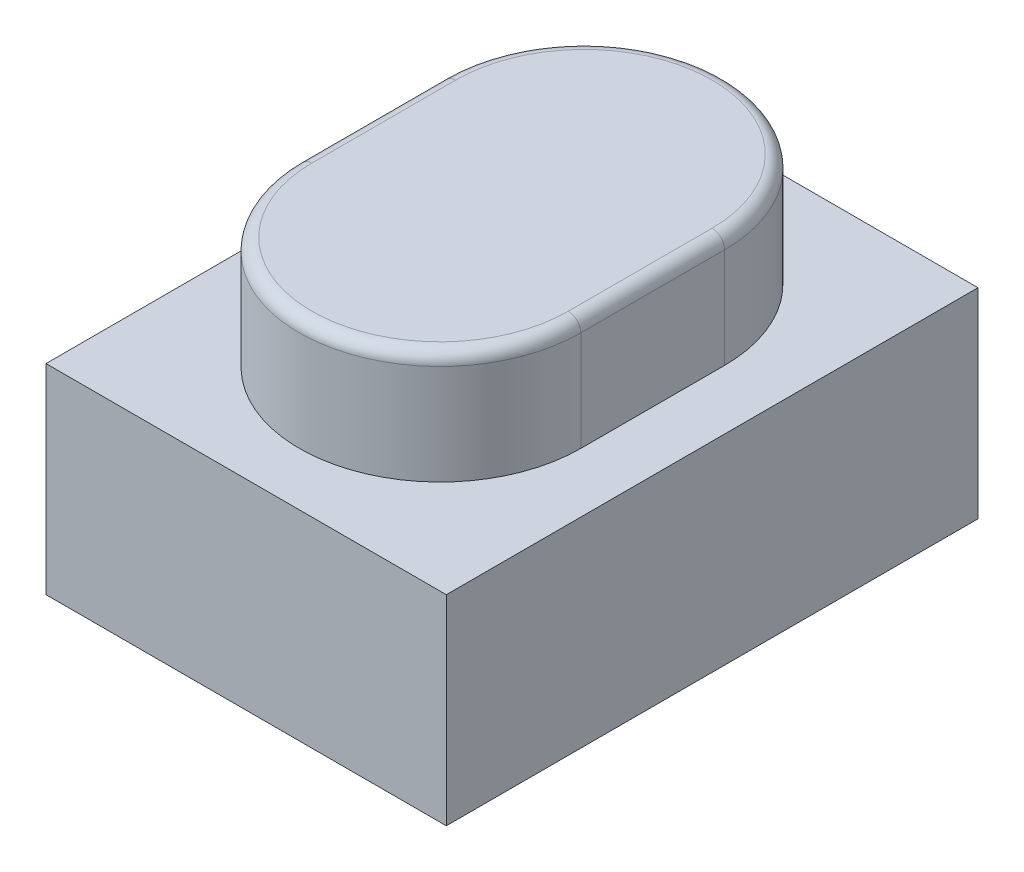
ISO-10303-21;
HEADER;
FILE_DESCRIPTION(('STEP AP214'),'2;1');
FILE_NAME('part.step','',(''),(''),'','','');
FILE_SCHEMA(('AUTOMOTIVE_DESIGN { 1 0 10303 214 1 1 1 1 }'));
ENDSEC;
DATA;
#1=APPLICATION_CONTEXT('core data for automotive mechanical design processes');
#2=APPLICATION_PROTOCOL_DEFINITION('international standard','automotive_design',2000,#1);
#3=PRODUCT_CONTEXT('',#1,'mechanical');
#4=PRODUCT('Part','Part','',(#3));
#5=PRODUCT_RELATED_PRODUCT_CATEGORY('part','',(#4));
#6=PRODUCT_DEFINITION_FORMATION('','',#4);
#7=PRODUCT_DEFINITION_CONTEXT('part definition',#1,'design');
#8=PRODUCT_DEFINITION('design','',#6,#7);
#9=PRODUCT_DEFINITION_SHAPE('','',#8);
#10=(LENGTH_UNIT() NAMED_UNIT(*) SI_UNIT(.MILLI.,.METRE.));
#11=(NAMED_UNIT(*) PLANE_ANGLE_UNIT() SI_UNIT($,.RADIAN.));
#12=(NAMED_UNIT(*) SI_UNIT($,.STERADIAN.) SOLID_ANGLE_UNIT());
#13=UNCERTAINTY_MEASURE_WITH_UNIT(LENGTH_MEASURE(1.E-05),#10,'distance_accuracy_value','');
#14=(GEOMETRIC_REPRESENTATION_CONTEXT(3) GLOBAL_UNCERTAINTY_ASSIGNED_CONTEXT((#13)) GLOBAL_UNIT_ASSIGNED_CONTEXT((#10,
#11,#12)) REPRESENTATION_CONTEXT('',''));
#15=CARTESIAN_POINT('',(0.,0.,0.));
#16=DIRECTION('',(0.,0.,1.));
#17=DIRECTION('',(1.,0.,0.));
#18=AXIS2_PLACEMENT_3D('',#15,#16,#17);
#19=CARTESIAN_POINT('',(1.6,1.6,-2.125));
#20=DIRECTION('',(-1.,0.,0.));
#21=DIRECTION('',(0.,0.,1.));
#22=AXIS2_PLACEMENT_3D('',#19,#20,#21);
#23=PLANE('',#22);
#24=DIRECTION('',(0.,0.,-1.));
#25=VECTOR('',#24,1.);
#26=CARTESIAN_POINT('',(1.6,0.,-2.125));
#27=LINE('',#26,#25);
#28=CARTESIAN_POINT('',(1.6,0.,2.125));
#29=VERTEX_POINT('',#28);
#30=CARTESIAN_POINT('',(1.6,0.,-2.125));
#31=VERTEX_POINT('',#30);
#32=EDGE_CURVE('E139',#29,#31,#27,.T.);
#33=ORIENTED_EDGE('',*,*,#32,.T.);
#34=DIRECTION('',(0.,-1.,0.));
#35=VECTOR('',#34,1.);
#36=CARTESIAN_POINT('',(1.6,1.6,-2.125));
#37=LINE('',#36,#35);
#38=CARTESIAN_POINT('',(1.6,1.6,-2.125));
#39=VERTEX_POINT('',#38);
#40=EDGE_CURVE('E166',#39,#31,#37,.T.);
#41=ORIENTED_EDGE('',*,*,#40,.F.);
#42=DIRECTION('',(0.,0.,-1.));
#43=VECTOR('',#42,1.);
#44=CARTESIAN_POINT('',(1.6,1.6,-2.125));
#45=LINE('',#44,#43);
#46=CARTESIAN_POINT('',(1.6,1.6,2.125));
#47=VERTEX_POINT('',#46);
#48=EDGE_CURVE('E140',#47,#39,#45,.T.);
#49=ORIENTED_EDGE('',*,*,#48,.F.);
#50=DIRECTION('',(0.,-1.,0.));
#51=VECTOR('',#50,1.);
#52=CARTESIAN_POINT('',(1.6,1.6,2.125));
#53=LINE('',#52,#51);
#54=EDGE_CURVE('E150',#47,#29,#53,.T.);
#55=ORIENTED_EDGE('',*,*,#54,.T.);
#56=EDGE_LOOP('',(#33,#41,#49,#55));
#57=FACE_BOUND('',#56,.T.);
#58=ADVANCED_FACE('F34',(#57),#23,.F.);
#59=CARTESIAN_POINT('',(-1.6,1.6,-2.125));
#60=DIRECTION('',(0.,0.,1.));
#61=DIRECTION('',(1.,0.,0.));
#62=AXIS2_PLACEMENT_3D('',#59,#60,#61);
#63=PLANE('',#62);
#64=DIRECTION('',(-1.,0.,0.));
#65=VECTOR('',#64,1.);
#66=CARTESIAN_POINT('',(-1.6,0.,-2.125));
#67=LINE('',#66,#65);
#68=CARTESIAN_POINT('',(-1.6,0.,-2.125));
#69=VERTEX_POINT('',#68);
#70=EDGE_CURVE('E153',#31,#69,#67,.T.);
#71=ORIENTED_EDGE('',*,*,#70,.T.);
#72=DIRECTION('',(0.,-1.,0.));
#73=VECTOR('',#72,1.);
#74=CARTESIAN_POINT('',(-1.6,1.6,-2.125));
#75=LINE('',#74,#73);
#76=CARTESIAN_POINT('',(-1.6,1.6,-2.125));
#77=VERTEX_POINT('',#76);
#78=EDGE_CURVE('E163',#77,#69,#75,.T.);
#79=ORIENTED_EDGE('',*,*,#78,.F.);
#80=DIRECTION('',(-1.,0.,0.));
#81=VECTOR('',#80,1.);
#82=CARTESIAN_POINT('',(-1.6,1.6,-2.125));
#83=LINE('',#82,#81);
#84=EDGE_CURVE('E143',#39,#77,#83,.T.);
#85=ORIENTED_EDGE('',*,*,#84,.F.);
#86=ORIENTED_EDGE('',*,*,#40,.T.);
#87=EDGE_LOOP('',(#71,#79,#85,#86));
#88=FACE_BOUND('',#87,.T.);
#89=ADVANCED_FACE('F221',(#88),#63,.F.);
#90=CARTESIAN_POINT('',(-1.6,1.6,-2.125));
#91=DIRECTION('',(1.,0.,0.));
#92=DIRECTION('',(0.,0.,-1.));
#93=AXIS2_PLACEMENT_3D('',#90,#91,#92);
#94=PLANE('',#93);
#95=DIRECTION('',(0.,0.,1.));
#96=VECTOR('',#95,1.);
#97=CARTESIAN_POINT('',(-1.6,0.,-2.125));
#98=LINE('',#97,#96);
#99=CARTESIAN_POINT('',(-1.6,0.,2.125));
#100=VERTEX_POINT('',#99);
#101=EDGE_CURVE('E155',#69,#100,#98,.T.);
#102=ORIENTED_EDGE('',*,*,#101,.T.);
#103=DIRECTION('',(0.,-1.,0.));
#104=VECTOR('',#103,1.);
#105=CARTESIAN_POINT('',(-1.6,1.6,2.125));
#106=LINE('',#105,#104);
#107=CARTESIAN_POINT('',(-1.6,1.6,2.125));
#108=VERTEX_POINT('',#107);
#109=EDGE_CURVE('E160',#108,#100,#106,.T.);
#110=ORIENTED_EDGE('',*,*,#109,.F.);
#111=DIRECTION('',(0.,0.,1.));
#112=VECTOR('',#111,1.);
#113=CARTESIAN_POINT('',(-1.6,1.6,-2.125));
#114=LINE('',#113,#112);
#115=EDGE_CURVE('E146',#77,#108,#114,.T.);
#116=ORIENTED_EDGE('',*,*,#115,.F.);
#117=ORIENTED_EDGE('',*,*,#78,.T.);
#118=EDGE_LOOP('',(#102,#110,#116,#117));
#119=FACE_BOUND('',#118,.T.);
#120=ADVANCED_FACE('F227',(#119),#94,.F.);
#121=CARTESIAN_POINT('',(-1.6,1.6,2.125));
#122=DIRECTION('',(0.,0.,-1.));
#123=DIRECTION('',(-1.,0.,0.));
#124=AXIS2_PLACEMENT_3D('',#121,#122,#123);
#125=PLANE('',#124);
#126=DIRECTION('',(1.,0.,0.));
#127=VECTOR('',#126,1.);
#128=CARTESIAN_POINT('',(-1.6,0.,2.125));
#129=LINE('',#128,#127);
#130=EDGE_CURVE('E144',#100,#29,#129,.T.);
#131=ORIENTED_EDGE('',*,*,#130,.T.);
#132=ORIENTED_EDGE('',*,*,#54,.F.);
#133=DIRECTION('',(1.,0.,0.));
#134=VECTOR('',#133,1.);
#135=CARTESIAN_POINT('',(-1.6,1.6,2.125));
#136=LINE('',#135,#134);
#137=EDGE_CURVE('E148',#108,#47,#136,.T.);
#138=ORIENTED_EDGE('',*,*,#137,.F.);
#139=ORIENTED_EDGE('',*,*,#109,.T.);
#140=EDGE_LOOP('',(#131,#132,#138,#139));
#141=FACE_BOUND('',#140,.T.);
#142=ADVANCED_FACE('F306',(#141),#125,.F.);
#143=CARTESIAN_POINT('',(0.,1.6,0.));
#144=DIRECTION('',(0.,1.,0.));
#145=DIRECTION('',(0.,0.,1.));
#146=AXIS2_PLACEMENT_3D('',#143,#144,#145);
#147=PLANE('',#146);
#148=CARTESIAN_POINT('',(0.,1.6,-0.575));
#149=DIRECTION('',(0.,1.,0.));
#150=DIRECTION('',(0.,0.,1.));
#151=AXIS2_PLACEMENT_3D('',#148,#149,#150);
#152=CIRCLE('',#151,1.125);
#153=CARTESIAN_POINT('',(1.125,1.6,-0.575000000000001));
#154=VERTEX_POINT('',#153);
#155=CARTESIAN_POINT('',(-1.125,1.6,-0.575));
#156=VERTEX_POINT('',#155);
#157=EDGE_CURVE('E130',#154,#156,#152,.T.);
#158=ORIENTED_EDGE('',*,*,#157,.F.);
#159=DIRECTION('',(0.,0.,-1.));
#160=VECTOR('',#159,1.);
#161=CARTESIAN_POINT('',(1.125,1.6,-0.575000000000001));
#162=LINE('',#161,#160);
#163=CARTESIAN_POINT('',(1.125,1.6,0.575));
#164=VERTEX_POINT('',#163);
#165=EDGE_CURVE('E127',#164,#154,#162,.T.);
#166=ORIENTED_EDGE('',*,*,#165,.F.);
#167=CARTESIAN_POINT('',(0.,1.6,0.575));
#168=DIRECTION('',(0.,1.,0.));
#169=DIRECTION('',(0.,0.,1.));
#170=AXIS2_PLACEMENT_3D('',#167,#168,#169);
#171=CIRCLE('',#170,1.125);
#172=CARTESIAN_POINT('',(-1.125,1.6,0.575));
#173=VERTEX_POINT('',#172);
#174=EDGE_CURVE('E113',#173,#164,#171,.T.);
#175=ORIENTED_EDGE('',*,*,#174,.F.);
#176=DIRECTION('',(0.,0.,1.));
#177=VECTOR('',#176,1.);
#178=CARTESIAN_POINT('',(-1.125,1.6,-0.575));
#179=LINE('',#178,#177);
#180=EDGE_CURVE('E124',#156,#173,#179,.T.);
#181=ORIENTED_EDGE('',*,*,#180,.F.);
#182=EDGE_LOOP('',(#158,#166,#175,#181));
#183=FACE_BOUND('',#182,.T.);
#184=ORIENTED_EDGE('',*,*,#48,.T.);
#185=ORIENTED_EDGE('',*,*,#84,.T.);
#186=ORIENTED_EDGE('',*,*,#115,.T.);
#187=ORIENTED_EDGE('',*,*,#137,.T.);
#188=EDGE_LOOP('',(#184,#185,#186,#187));
#189=FACE_BOUND('',#188,.T.);
#190=ADVANCED_FACE('F122',(#183,#189),#147,.T.);
#191=CARTESIAN_POINT('',(0.,0.,0.));
#192=DIRECTION('',(0.,1.,0.));
#193=DIRECTION('',(0.,0.,1.));
#194=AXIS2_PLACEMENT_3D('',#191,#192,#193);
#195=PLANE('',#194);
#196=ORIENTED_EDGE('',*,*,#32,.F.);
#197=ORIENTED_EDGE('',*,*,#130,.F.);
#198=ORIENTED_EDGE('',*,*,#101,.F.);
#199=ORIENTED_EDGE('',*,*,#70,.F.);
#200=EDGE_LOOP('',(#196,#197,#198,#199));
#201=FACE_BOUND('',#200,.T.);
#202=ADVANCED_FACE('F289',(#201),#195,.F.);
#203=CARTESIAN_POINT('',(0.,2.5,-0.575));
#204=DIRECTION('',(0.,-1.,0.));
#205=DIRECTION('',(0.,0.,-1.));
#206=AXIS2_PLACEMENT_3D('',#203,#204,#205);
#207=CYLINDRICAL_SURFACE('',#206,1.125);
#208=DIRECTION('',(0.,-1.,0.));
#209=VECTOR('',#208,1.);
#210=CARTESIAN_POINT('',(-1.125,2.5,-0.575));
#211=LINE('',#210,#209);
#212=CARTESIAN_POINT('',(-1.125,2.4,-0.575));
#213=VERTEX_POINT('',#212);
#214=EDGE_CURVE('E115',#213,#156,#211,.T.);
#215=ORIENTED_EDGE('',*,*,#214,.F.);
#216=CARTESIAN_POINT('',(0.,2.4,-0.575));
#217=DIRECTION('',(0.,1.,0.));
#218=DIRECTION('',(0.,0.,1.));
#219=AXIS2_PLACEMENT_3D('',#216,#217,#218);
#220=CIRCLE('',#219,1.125);
#221=CARTESIAN_POINT('',(1.125,2.4,-0.575000000000001));
#222=VERTEX_POINT('',#221);
#223=EDGE_CURVE('E11',#213,#222,#220,.F.);
#224=ORIENTED_EDGE('',*,*,#223,.T.);
#225=DIRECTION('',(0.,-1.,0.));
#226=VECTOR('',#225,1.);
#227=CARTESIAN_POINT('',(1.125,2.5,-0.575000000000001));
#228=LINE('',#227,#226);
#229=EDGE_CURVE('E135',#222,#154,#228,.T.);
#230=ORIENTED_EDGE('',*,*,#229,.T.);
#231=ORIENTED_EDGE('',*,*,#157,.T.);
#232=EDGE_LOOP('',(#215,#224,#230,#231));
#233=FACE_BOUND('',#232,.T.);
#234=ADVANCED_FACE('F204',(#233),#207,.T.);
#235=CARTESIAN_POINT('',(-1.125,2.5,-0.575));
#236=DIRECTION('',(1.,0.,0.));
#237=DIRECTION('',(0.,0.,-1.));
#238=AXIS2_PLACEMENT_3D('',#235,#236,#237);
#239=PLANE('',#238);
#240=DIRECTION('',(0.,-1.,0.));
#241=VECTOR('',#240,1.);
#242=CARTESIAN_POINT('',(-1.125,2.5,0.575));
#243=LINE('',#242,#241);
#244=CARTESIAN_POINT('',(-1.125,2.4,0.575));
#245=VERTEX_POINT('',#244);
#246=EDGE_CURVE('E110',#245,#173,#243,.T.);
#247=ORIENTED_EDGE('',*,*,#246,.F.);
#248=DIRECTION('',(0.,0.,1.));
#249=VECTOR('',#248,1.);
#250=CARTESIAN_POINT('',(-1.125,2.4,-0.575));
#251=LINE('',#250,#249);
#252=EDGE_CURVE('E43',#245,#213,#251,.F.);
#253=ORIENTED_EDGE('',*,*,#252,.T.);
#254=ORIENTED_EDGE('',*,*,#214,.T.);
#255=ORIENTED_EDGE('',*,*,#180,.T.);
#256=EDGE_LOOP('',(#247,#253,#254,#255));
#257=FACE_BOUND('',#256,.T.);
#258=ADVANCED_FACE('F129',(#257),#239,.F.);
#259=CARTESIAN_POINT('',(0.,2.5,0.575));
#260=DIRECTION('',(0.,-1.,0.));
#261=DIRECTION('',(0.,0.,-1.));
#262=AXIS2_PLACEMENT_3D('',#259,#260,#261);
#263=CYLINDRICAL_SURFACE('',#262,1.125);
#264=DIRECTION('',(0.,-1.,0.));
#265=VECTOR('',#264,1.);
#266=CARTESIAN_POINT('',(1.125,2.5,0.575));
#267=LINE('',#266,#265);
#268=CARTESIAN_POINT('',(1.125,2.4,0.575));
#269=VERTEX_POINT('',#268);
#270=EDGE_CURVE('E116',#269,#164,#267,.T.);
#271=ORIENTED_EDGE('',*,*,#270,.F.);
#272=CARTESIAN_POINT('',(0.,2.4,0.575));
#273=DIRECTION('',(0.,1.,0.));
#274=DIRECTION('',(0.,0.,1.));
#275=AXIS2_PLACEMENT_3D('',#272,#273,#274);
#276=CIRCLE('',#275,1.125);
#277=EDGE_CURVE('E58',#269,#245,#276,.F.);
#278=ORIENTED_EDGE('',*,*,#277,.T.);
#279=ORIENTED_EDGE('',*,*,#246,.T.);
#280=ORIENTED_EDGE('',*,*,#174,.T.);
#281=EDGE_LOOP('',(#271,#278,#279,#280));
#282=FACE_BOUND('',#281,.T.);
#283=ADVANCED_FACE('F112',(#282),#263,.T.);
#284=CARTESIAN_POINT('',(1.125,2.5,-0.575000000000001));
#285=DIRECTION('',(-1.,0.,0.));
#286=DIRECTION('',(0.,0.,1.));
#287=AXIS2_PLACEMENT_3D('',#284,#285,#286);
#288=PLANE('',#287);
#289=ORIENTED_EDGE('',*,*,#229,.F.);
#290=DIRECTION('',(0.,0.,-1.));
#291=VECTOR('',#290,1.);
#292=CARTESIAN_POINT('',(1.125,2.4,0.575));
#293=LINE('',#292,#291);
#294=EDGE_CURVE('E178',#222,#269,#293,.F.);
#295=ORIENTED_EDGE('',*,*,#294,.T.);
#296=ORIENTED_EDGE('',*,*,#270,.T.);
#297=ORIENTED_EDGE('',*,*,#165,.T.);
#298=EDGE_LOOP('',(#289,#295,#296,#297));
#299=FACE_BOUND('',#298,.T.);
#300=ADVANCED_FACE('F207',(#299),#288,.F.);
#301=CARTESIAN_POINT('',(0.,2.5,-0.575));
#302=DIRECTION('',(0.,1.,0.));
#303=DIRECTION('',(0.,0.,1.));
#304=AXIS2_PLACEMENT_3D('',#301,#302,#303);
#305=PLANE('',#304);
#306=CARTESIAN_POINT('',(0.,2.5,0.575));
#307=DIRECTION('',(0.,1.,0.));
#308=DIRECTION('',(0.,0.,1.));
#309=AXIS2_PLACEMENT_3D('',#306,#307,#308);
#310=CIRCLE('',#309,1.025);
#311=CARTESIAN_POINT('',(-1.025,2.5,0.575));
#312=VERTEX_POINT('',#311);
#313=CARTESIAN_POINT('',(1.025,2.5,0.575));
#314=VERTEX_POINT('',#313);
#315=EDGE_CURVE('E173',#312,#314,#310,.T.);
#316=ORIENTED_EDGE('',*,*,#315,.T.);
#317=DIRECTION('',(0.,0.,-1.));
#318=VECTOR('',#317,1.);
#319=CARTESIAN_POINT('',(1.025,2.5,-0.575000000000001));
#320=LINE('',#319,#318);
#321=CARTESIAN_POINT('',(1.025,2.5,-0.575000000000001));
#322=VERTEX_POINT('',#321);
#323=EDGE_CURVE('E175',#314,#322,#320,.T.);
#324=ORIENTED_EDGE('',*,*,#323,.T.);
#325=CARTESIAN_POINT('',(0.,2.5,-0.575));
#326=DIRECTION('',(0.,1.,0.));
#327=DIRECTION('',(0.,0.,1.));
#328=AXIS2_PLACEMENT_3D('',#325,#326,#327);
#329=CIRCLE('',#328,1.025);
#330=CARTESIAN_POINT('',(-1.025,2.5,-0.575));
#331=VERTEX_POINT('',#330);
#332=EDGE_CURVE('E169',#322,#331,#329,.T.);
#333=ORIENTED_EDGE('',*,*,#332,.T.);
#334=DIRECTION('',(0.,0.,1.));
#335=VECTOR('',#334,1.);
#336=CARTESIAN_POINT('',(-1.025,2.5,0.575));
#337=LINE('',#336,#335);
#338=EDGE_CURVE('E171',#331,#312,#337,.T.);
#339=ORIENTED_EDGE('',*,*,#338,.T.);
#340=EDGE_LOOP('',(#316,#324,#333,#339));
#341=FACE_BOUND('',#340,.T.);
#342=ADVANCED_FACE('F212',(#341),#305,.T.);
#343=CARTESIAN_POINT('',(-1.025,2.4,-0.575));
#344=DIRECTION('',(0.,0.,-1.));
#345=DIRECTION('',(-1.,0.,0.));
#346=AXIS2_PLACEMENT_3D('',#343,#344,#345);
#347=CYLINDRICAL_SURFACE('',#346,0.1);
#348=CARTESIAN_POINT('',(-1.025,2.4,-0.575));
#349=DIRECTION('',(0.,0.,-1.));
#350=DIRECTION('',(-1.,0.,0.));
#351=AXIS2_PLACEMENT_3D('',#348,#349,#350);
#352=CIRCLE('',#351,0.1);
#353=EDGE_CURVE('E186',#213,#331,#352,.T.);
#354=ORIENTED_EDGE('',*,*,#353,.F.);
#355=ORIENTED_EDGE('',*,*,#252,.F.);
#356=CARTESIAN_POINT('',(-1.025,2.4,0.575));
#357=DIRECTION('',(0.,0.,1.));
#358=DIRECTION('',(1.,0.,0.));
#359=AXIS2_PLACEMENT_3D('',#356,#357,#358);
#360=CIRCLE('',#359,0.1);
#361=EDGE_CURVE('E38',#312,#245,#360,.T.);
#362=ORIENTED_EDGE('',*,*,#361,.F.);
#363=ORIENTED_EDGE('',*,*,#338,.F.);
#364=EDGE_LOOP('',(#354,#355,#362,#363));
#365=FACE_BOUND('',#364,.T.);
#366=ADVANCED_FACE('F36',(#365),#347,.T.);
#367=CARTESIAN_POINT('',(0.,2.4,0.575));
#368=DIRECTION('',(0.,1.,0.));
#369=DIRECTION('',(0.,0.,1.));
#370=AXIS2_PLACEMENT_3D('',#367,#368,#369);
#371=TOROIDAL_SURFACE('',#370,1.025,0.1);
#372=ORIENTED_EDGE('',*,*,#361,.T.);
#373=ORIENTED_EDGE('',*,*,#277,.F.);
#374=CARTESIAN_POINT('',(1.025,2.4,0.575));
#375=DIRECTION('',(0.,0.,-1.));
#376=DIRECTION('',(-1.,0.,0.));
#377=AXIS2_PLACEMENT_3D('',#374,#375,#376);
#378=CIRCLE('',#377,0.1);
#379=EDGE_CURVE('E185',#314,#269,#378,.T.);
#380=ORIENTED_EDGE('',*,*,#379,.F.);
#381=ORIENTED_EDGE('',*,*,#315,.F.);
#382=EDGE_LOOP('',(#372,#373,#380,#381));
#383=FACE_BOUND('',#382,.T.);
#384=ADVANCED_FACE('F196',(#383),#371,.T.);
#385=CARTESIAN_POINT('',(0.,2.4,-0.575));
#386=DIRECTION('',(0.,1.,0.));
#387=DIRECTION('',(0.,0.,1.));
#388=AXIS2_PLACEMENT_3D('',#385,#386,#387);
#389=TOROIDAL_SURFACE('',#388,1.025,0.1);
#390=ORIENTED_EDGE('',*,*,#353,.T.);
#391=ORIENTED_EDGE('',*,*,#332,.F.);
#392=CARTESIAN_POINT('',(1.025,2.4,-0.575000000000001));
#393=DIRECTION('',(0.,0.,1.));
#394=DIRECTION('',(1.,0.,0.));
#395=AXIS2_PLACEMENT_3D('',#392,#393,#394);
#396=CIRCLE('',#395,0.1);
#397=EDGE_CURVE('E183',#222,#322,#396,.T.);
#398=ORIENTED_EDGE('',*,*,#397,.F.);
#399=ORIENTED_EDGE('',*,*,#223,.F.);
#400=EDGE_LOOP('',(#390,#391,#398,#399));
#401=FACE_BOUND('',#400,.T.);
#402=ADVANCED_FACE('F201',(#401),#389,.T.);
#403=CARTESIAN_POINT('',(1.025,2.4,-0.575));
#404=DIRECTION('',(0.,0.,1.));
#405=DIRECTION('',(1.,0.,0.));
#406=AXIS2_PLACEMENT_3D('',#403,#404,#405);
#407=CYLINDRICAL_SURFACE('',#406,0.1);
#408=ORIENTED_EDGE('',*,*,#379,.T.);
#409=ORIENTED_EDGE('',*,*,#294,.F.);
#410=ORIENTED_EDGE('',*,*,#397,.T.);
#411=ORIENTED_EDGE('',*,*,#323,.F.);
#412=EDGE_LOOP('',(#408,#409,#410,#411));
#413=FACE_BOUND('',#412,.T.);
#414=ADVANCED_FACE('F209',(#413),#407,.T.);
#415=CLOSED_SHELL('',(#58,#89,#120,#142,#190,#202,#234,#258,#283,#300,#342,#366,#384,#402,#414));
#416=MANIFOLD_SOLID_BREP('B2',#415);
#417=ADVANCED_BREP_SHAPE_REPRESENTATION('',(#18,#416),#14);
#418=SHAPE_DEFINITION_REPRESENTATION(#9,#417);
ENDSEC;
END-ISO-10303-21;
